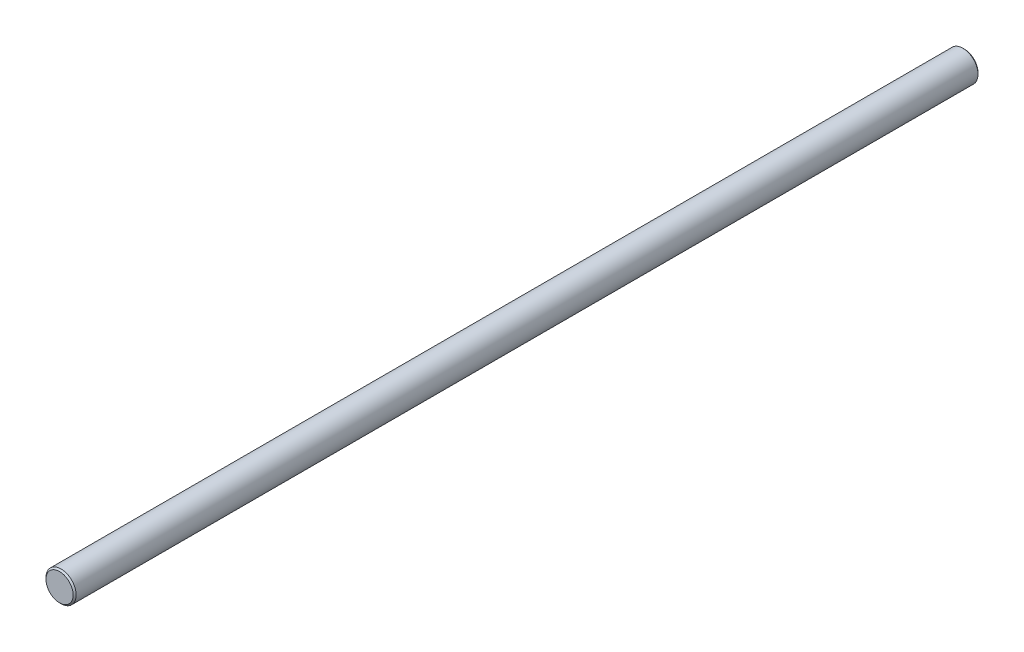
ISO-10303-21;
HEADER;
FILE_DESCRIPTION(('STEP AP214'),'2;1');
FILE_NAME('part.step','',(''),(''),'','','');
FILE_SCHEMA(('AUTOMOTIVE_DESIGN { 1 0 10303 214 1 1 1 1 }'));
ENDSEC;
DATA;
#1=APPLICATION_CONTEXT('core data for automotive mechanical design processes');
#2=APPLICATION_PROTOCOL_DEFINITION('international standard','automotive_design',2000,#1);
#3=PRODUCT_CONTEXT('',#1,'mechanical');
#4=PRODUCT('Part','Part','',(#3));
#5=PRODUCT_RELATED_PRODUCT_CATEGORY('part','',(#4));
#6=PRODUCT_DEFINITION_FORMATION('','',#4);
#7=PRODUCT_DEFINITION_CONTEXT('part definition',#1,'design');
#8=PRODUCT_DEFINITION('design','',#6,#7);
#9=PRODUCT_DEFINITION_SHAPE('','',#8);
#10=(LENGTH_UNIT() NAMED_UNIT(*) SI_UNIT(.MILLI.,.METRE.));
#11=(NAMED_UNIT(*) PLANE_ANGLE_UNIT() SI_UNIT($,.RADIAN.));
#12=(NAMED_UNIT(*) SI_UNIT($,.STERADIAN.) SOLID_ANGLE_UNIT());
#13=UNCERTAINTY_MEASURE_WITH_UNIT(LENGTH_MEASURE(1.E-05),#10,'distance_accuracy_value','');
#14=(GEOMETRIC_REPRESENTATION_CONTEXT(3) GLOBAL_UNCERTAINTY_ASSIGNED_CONTEXT((#13)) GLOBAL_UNIT_ASSIGNED_CONTEXT((#10,
#11,#12)) REPRESENTATION_CONTEXT('',''));
#15=CARTESIAN_POINT('',(0.,0.,0.));
#16=DIRECTION('',(0.,0.,1.));
#17=DIRECTION('',(1.,0.,0.));
#18=AXIS2_PLACEMENT_3D('',#15,#16,#17);
#19=CARTESIAN_POINT('',(0.,0.,300.));
#20=DIRECTION('',(0.,0.,-1.));
#21=DIRECTION('',(-1.,0.,0.));
#22=AXIS2_PLACEMENT_3D('',#19,#20,#21);
#23=CYLINDRICAL_SURFACE('',#22,5.);
#24=CARTESIAN_POINT('',(0.,0.,299.5));
#25=DIRECTION('',(0.,0.,1.));
#26=DIRECTION('',(1.,0.,0.));
#27=AXIS2_PLACEMENT_3D('',#24,#25,#26);
#28=CIRCLE('',#27,5.);
#29=CARTESIAN_POINT('',(5.,0.,299.5));
#30=VERTEX_POINT('',#29);
#31=EDGE_CURVE('E37',#30,#30,#28,.F.);
#32=ORIENTED_EDGE('',*,*,#31,.T.);
#33=EDGE_LOOP('',(#32));
#34=FACE_BOUND('',#33,.T.);
#35=CARTESIAN_POINT('',(0.,0.,0.500000000000056));
#36=DIRECTION('',(0.,0.,1.));
#37=DIRECTION('',(1.,0.,0.));
#38=AXIS2_PLACEMENT_3D('',#35,#36,#37);
#39=CIRCLE('',#38,5.);
#40=CARTESIAN_POINT('',(5.,0.,0.500000000000056));
#41=VERTEX_POINT('',#40);
#42=EDGE_CURVE('E41',#41,#41,#39,.T.);
#43=ORIENTED_EDGE('',*,*,#42,.T.);
#44=EDGE_LOOP('',(#43));
#45=FACE_BOUND('',#44,.T.);
#46=ADVANCED_FACE('F30',(#34,#45),#23,.T.);
#47=CARTESIAN_POINT('',(0.,0.,300.));
#48=DIRECTION('',(0.,0.,1.));
#49=DIRECTION('',(1.,0.,0.));
#50=AXIS2_PLACEMENT_3D('',#47,#48,#49);
#51=PLANE('',#50);
#52=CARTESIAN_POINT('',(0.,0.,300.));
#53=DIRECTION('',(0.,0.,1.));
#54=DIRECTION('',(1.,0.,0.));
#55=AXIS2_PLACEMENT_3D('',#52,#53,#54);
#56=CIRCLE('',#55,4.49999999999995);
#57=CARTESIAN_POINT('',(4.49999999999995,0.,300.));
#58=VERTEX_POINT('',#57);
#59=EDGE_CURVE('E45',#58,#58,#56,.T.);
#60=ORIENTED_EDGE('',*,*,#59,.T.);
#61=EDGE_LOOP('',(#60));
#62=FACE_BOUND('',#61,.T.);
#63=ADVANCED_FACE('F51',(#62),#51,.T.);
#64=CARTESIAN_POINT('',(0.,0.,0.));
#65=DIRECTION('',(0.,0.,1.));
#66=DIRECTION('',(1.,0.,0.));
#67=AXIS2_PLACEMENT_3D('',#64,#65,#66);
#68=PLANE('',#67);
#69=CARTESIAN_POINT('',(0.,0.,0.));
#70=DIRECTION('',(0.,0.,1.));
#71=DIRECTION('',(1.,0.,0.));
#72=AXIS2_PLACEMENT_3D('',#69,#70,#71);
#73=CIRCLE('',#72,4.49999999999998);
#74=CARTESIAN_POINT('',(4.49999999999998,0.,0.));
#75=VERTEX_POINT('',#74);
#76=EDGE_CURVE('E10',#75,#75,#73,.F.);
#77=ORIENTED_EDGE('',*,*,#76,.T.);
#78=EDGE_LOOP('',(#77));
#79=FACE_BOUND('',#78,.T.);
#80=ADVANCED_FACE('F55',(#79),#68,.F.);
#81=CARTESIAN_POINT('',(0.,0.,300.));
#82=DIRECTION('',(0.,0.,-1.));
#83=DIRECTION('',(-1.,0.,0.));
#84=AXIS2_PLACEMENT_3D('',#81,#82,#83);
#85=CONICAL_SURFACE('',#84,4.49999999999995,0.785398163397499);
#86=ORIENTED_EDGE('',*,*,#31,.F.);
#87=EDGE_LOOP('',(#86));
#88=FACE_BOUND('',#87,.T.);
#89=ORIENTED_EDGE('',*,*,#59,.F.);
#90=EDGE_LOOP('',(#89));
#91=FACE_BOUND('',#90,.T.);
#92=ADVANCED_FACE('F53',(#88,#91),#85,.T.);
#93=CARTESIAN_POINT('',(0.,0.,0.500000000000056));
#94=DIRECTION('',(0.,0.,1.));
#95=DIRECTION('',(1.,0.,0.));
#96=AXIS2_PLACEMENT_3D('',#93,#94,#95);
#97=CONICAL_SURFACE('',#96,5.,0.785398163397416);
#98=ORIENTED_EDGE('',*,*,#76,.F.);
#99=EDGE_LOOP('',(#98));
#100=FACE_BOUND('',#99,.T.);
#101=ORIENTED_EDGE('',*,*,#42,.F.);
#102=EDGE_LOOP('',(#101));
#103=FACE_BOUND('',#102,.T.);
#104=ADVANCED_FACE('F32',(#100,#103),#97,.T.);
#105=CLOSED_SHELL('',(#46,#63,#80,#92,#104));
#106=MANIFOLD_SOLID_BREP('B2',#105);
#107=ADVANCED_BREP_SHAPE_REPRESENTATION('',(#18,#106),#14);
#108=SHAPE_DEFINITION_REPRESENTATION(#9,#107);
ENDSEC;
END-ISO-10303-21;
